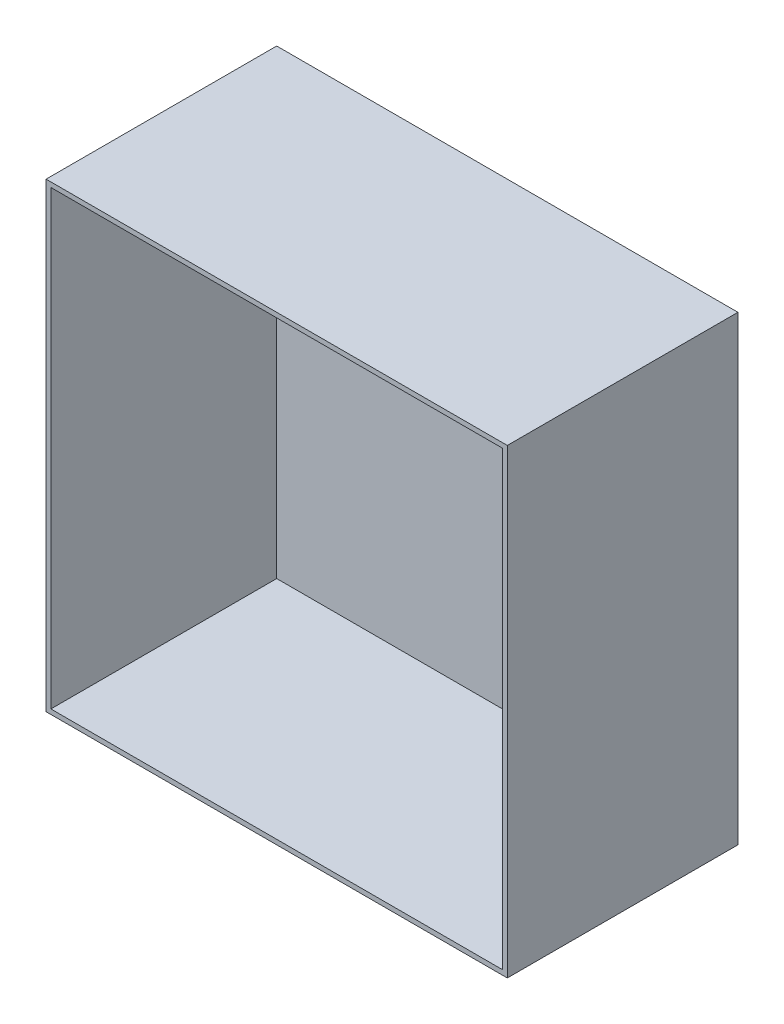
ISO-10303-21;
HEADER;
FILE_DESCRIPTION(('STEP AP214'),'2;1');
FILE_NAME('part.step','',(''),(''),'','','');
FILE_SCHEMA(('AUTOMOTIVE_DESIGN { 1 0 10303 214 1 1 1 1 }'));
ENDSEC;
DATA;
#1=APPLICATION_CONTEXT('core data for automotive mechanical design processes');
#2=APPLICATION_PROTOCOL_DEFINITION('international standard','automotive_design',2000,#1);
#3=PRODUCT_CONTEXT('',#1,'mechanical');
#4=PRODUCT('Part','Part','',(#3));
#5=PRODUCT_RELATED_PRODUCT_CATEGORY('part','',(#4));
#6=PRODUCT_DEFINITION_FORMATION('','',#4);
#7=PRODUCT_DEFINITION_CONTEXT('part definition',#1,'design');
#8=PRODUCT_DEFINITION('design','',#6,#7);
#9=PRODUCT_DEFINITION_SHAPE('','',#8);
#10=(LENGTH_UNIT() NAMED_UNIT(*) SI_UNIT(.MILLI.,.METRE.));
#11=(NAMED_UNIT(*) PLANE_ANGLE_UNIT() SI_UNIT($,.RADIAN.));
#12=(NAMED_UNIT(*) SI_UNIT($,.STERADIAN.) SOLID_ANGLE_UNIT());
#13=UNCERTAINTY_MEASURE_WITH_UNIT(LENGTH_MEASURE(1.E-05),#10,'distance_accuracy_value','');
#14=(GEOMETRIC_REPRESENTATION_CONTEXT(3) GLOBAL_UNCERTAINTY_ASSIGNED_CONTEXT((#13)) GLOBAL_UNIT_ASSIGNED_CONTEXT((#10,
#11,#12)) REPRESENTATION_CONTEXT('',''));
#15=CARTESIAN_POINT('',(0.,0.,0.));
#16=DIRECTION('',(0.,0.,1.));
#17=DIRECTION('',(1.,0.,0.));
#18=AXIS2_PLACEMENT_3D('',#15,#16,#17);
#19=CARTESIAN_POINT('',(0.,0.,76.2));
#20=DIRECTION('',(0.,0.,-1.));
#21=DIRECTION('',(-1.,0.,0.));
#22=AXIS2_PLACEMENT_3D('',#19,#20,#21);
#23=PLANE('',#22);
#24=DIRECTION('',(0.,-1.,0.));
#25=VECTOR('',#24,1.);
#26=CARTESIAN_POINT('',(0.,0.,76.2));
#27=LINE('',#26,#25);
#28=CARTESIAN_POINT('',(0.,152.4,76.2));
#29=VERTEX_POINT('',#28);
#30=CARTESIAN_POINT('',(0.,0.,76.2));
#31=VERTEX_POINT('',#30);
#32=EDGE_CURVE('E157',#29,#31,#27,.T.);
#33=ORIENTED_EDGE('',*,*,#32,.T.);
#34=DIRECTION('',(1.,0.,0.));
#35=VECTOR('',#34,1.);
#36=CARTESIAN_POINT('',(0.,0.,76.2));
#37=LINE('',#36,#35);
#38=CARTESIAN_POINT('',(152.4,0.,76.2));
#39=VERTEX_POINT('',#38);
#40=EDGE_CURVE('E92',#31,#39,#37,.T.);
#41=ORIENTED_EDGE('',*,*,#40,.T.);
#42=DIRECTION('',(0.,1.,0.));
#43=VECTOR('',#42,1.);
#44=CARTESIAN_POINT('',(152.4,0.,76.2));
#45=LINE('',#44,#43);
#46=CARTESIAN_POINT('',(152.4,152.4,76.2));
#47=VERTEX_POINT('',#46);
#48=EDGE_CURVE('E162',#39,#47,#45,.T.);
#49=ORIENTED_EDGE('',*,*,#48,.T.);
#50=DIRECTION('',(-1.,0.,0.));
#51=VECTOR('',#50,1.);
#52=CARTESIAN_POINT('',(0.,152.4,76.2));
#53=LINE('',#52,#51);
#54=EDGE_CURVE('E64',#47,#29,#53,.T.);
#55=ORIENTED_EDGE('',*,*,#54,.T.);
#56=EDGE_LOOP('',(#33,#41,#49,#55));
#57=FACE_BOUND('',#56,.T.);
#58=DIRECTION('',(0.,-1.,0.));
#59=VECTOR('',#58,1.);
#60=CARTESIAN_POINT('',(1.5875,0.,76.2));
#61=LINE('',#60,#59);
#62=CARTESIAN_POINT('',(1.5875,150.8125,76.2));
#63=VERTEX_POINT('',#62);
#64=CARTESIAN_POINT('',(1.5875,1.5875,76.2));
#65=VERTEX_POINT('',#64);
#66=EDGE_CURVE('E141',#63,#65,#61,.T.);
#67=ORIENTED_EDGE('',*,*,#66,.F.);
#68=DIRECTION('',(-1.,0.,0.));
#69=VECTOR('',#68,1.);
#70=CARTESIAN_POINT('',(0.,150.8125,76.2));
#71=LINE('',#70,#69);
#72=CARTESIAN_POINT('',(150.8125,150.8125,76.2));
#73=VERTEX_POINT('',#72);
#74=EDGE_CURVE('E154',#73,#63,#71,.T.);
#75=ORIENTED_EDGE('',*,*,#74,.F.);
#76=DIRECTION('',(0.,1.,0.));
#77=VECTOR('',#76,1.);
#78=CARTESIAN_POINT('',(150.8125,0.,76.2));
#79=LINE('',#78,#77);
#80=CARTESIAN_POINT('',(150.8125,1.5875,76.2));
#81=VERTEX_POINT('',#80);
#82=EDGE_CURVE('E151',#81,#73,#79,.T.);
#83=ORIENTED_EDGE('',*,*,#82,.F.);
#84=DIRECTION('',(1.,0.,0.));
#85=VECTOR('',#84,1.);
#86=CARTESIAN_POINT('',(0.,1.5875,76.2));
#87=LINE('',#86,#85);
#88=EDGE_CURVE('E130',#65,#81,#87,.T.);
#89=ORIENTED_EDGE('',*,*,#88,.F.);
#90=EDGE_LOOP('',(#67,#75,#83,#89));
#91=FACE_BOUND('',#90,.T.);
#92=ADVANCED_FACE('F39',(#57,#91),#23,.F.);
#93=CARTESIAN_POINT('',(0.,0.,76.2));
#94=DIRECTION('',(1.,0.,0.));
#95=DIRECTION('',(0.,0.,-1.));
#96=AXIS2_PLACEMENT_3D('',#93,#94,#95);
#97=PLANE('',#96);
#98=DIRECTION('',(0.,-1.,0.));
#99=VECTOR('',#98,1.);
#100=CARTESIAN_POINT('',(0.,0.,0.));
#101=LINE('',#100,#99);
#102=CARTESIAN_POINT('',(0.,152.4,0.));
#103=VERTEX_POINT('',#102);
#104=CARTESIAN_POINT('',(0.,0.,0.));
#105=VERTEX_POINT('',#104);
#106=EDGE_CURVE('E168',#103,#105,#101,.T.);
#107=ORIENTED_EDGE('',*,*,#106,.T.);
#108=DIRECTION('',(0.,0.,-1.));
#109=VECTOR('',#108,1.);
#110=CARTESIAN_POINT('',(0.,0.,76.2));
#111=LINE('',#110,#109);
#112=EDGE_CURVE('E11',#31,#105,#111,.T.);
#113=ORIENTED_EDGE('',*,*,#112,.F.);
#114=ORIENTED_EDGE('',*,*,#32,.F.);
#115=DIRECTION('',(0.,0.,-1.));
#116=VECTOR('',#115,1.);
#117=CARTESIAN_POINT('',(0.,152.4,76.2));
#118=LINE('',#117,#116);
#119=EDGE_CURVE('E167',#29,#103,#118,.T.);
#120=ORIENTED_EDGE('',*,*,#119,.T.);
#121=EDGE_LOOP('',(#107,#113,#114,#120));
#122=FACE_BOUND('',#121,.T.);
#123=ADVANCED_FACE('F41',(#122),#97,.F.);
#124=CARTESIAN_POINT('',(0.,0.,76.2));
#125=DIRECTION('',(0.,1.,0.));
#126=DIRECTION('',(0.,0.,1.));
#127=AXIS2_PLACEMENT_3D('',#124,#125,#126);
#128=PLANE('',#127);
#129=DIRECTION('',(1.,0.,0.));
#130=VECTOR('',#129,1.);
#131=CARTESIAN_POINT('',(0.,0.,0.));
#132=LINE('',#131,#130);
#133=CARTESIAN_POINT('',(152.4,0.,0.));
#134=VERTEX_POINT('',#133);
#135=EDGE_CURVE('E172',#105,#134,#132,.T.);
#136=ORIENTED_EDGE('',*,*,#135,.T.);
#137=DIRECTION('',(0.,0.,-1.));
#138=VECTOR('',#137,1.);
#139=CARTESIAN_POINT('',(152.4,0.,76.2));
#140=LINE('',#139,#138);
#141=EDGE_CURVE('E48',#39,#134,#140,.T.);
#142=ORIENTED_EDGE('',*,*,#141,.F.);
#143=ORIENTED_EDGE('',*,*,#40,.F.);
#144=ORIENTED_EDGE('',*,*,#112,.T.);
#145=EDGE_LOOP('',(#136,#142,#143,#144));
#146=FACE_BOUND('',#145,.T.);
#147=ADVANCED_FACE('F206',(#146),#128,.F.);
#148=CARTESIAN_POINT('',(152.4,0.,76.2));
#149=DIRECTION('',(-1.,0.,0.));
#150=DIRECTION('',(0.,0.,1.));
#151=AXIS2_PLACEMENT_3D('',#148,#149,#150);
#152=PLANE('',#151);
#153=DIRECTION('',(0.,1.,0.));
#154=VECTOR('',#153,1.);
#155=CARTESIAN_POINT('',(152.4,0.,0.));
#156=LINE('',#155,#154);
#157=CARTESIAN_POINT('',(152.4,152.4,0.));
#158=VERTEX_POINT('',#157);
#159=EDGE_CURVE('E175',#134,#158,#156,.T.);
#160=ORIENTED_EDGE('',*,*,#159,.T.);
#161=DIRECTION('',(0.,0.,-1.));
#162=VECTOR('',#161,1.);
#163=CARTESIAN_POINT('',(152.4,152.4,76.2));
#164=LINE('',#163,#162);
#165=EDGE_CURVE('E182',#47,#158,#164,.T.);
#166=ORIENTED_EDGE('',*,*,#165,.F.);
#167=ORIENTED_EDGE('',*,*,#48,.F.);
#168=ORIENTED_EDGE('',*,*,#141,.T.);
#169=EDGE_LOOP('',(#160,#166,#167,#168));
#170=FACE_BOUND('',#169,.T.);
#171=ADVANCED_FACE('F189',(#170),#152,.F.);
#172=CARTESIAN_POINT('',(0.,152.4,76.2));
#173=DIRECTION('',(0.,-1.,0.));
#174=DIRECTION('',(0.,0.,-1.));
#175=AXIS2_PLACEMENT_3D('',#172,#173,#174);
#176=PLANE('',#175);
#177=DIRECTION('',(-1.,0.,0.));
#178=VECTOR('',#177,1.);
#179=CARTESIAN_POINT('',(0.,152.4,0.));
#180=LINE('',#179,#178);
#181=EDGE_CURVE('E85',#158,#103,#180,.T.);
#182=ORIENTED_EDGE('',*,*,#181,.T.);
#183=ORIENTED_EDGE('',*,*,#119,.F.);
#184=ORIENTED_EDGE('',*,*,#54,.F.);
#185=ORIENTED_EDGE('',*,*,#165,.T.);
#186=EDGE_LOOP('',(#182,#183,#184,#185));
#187=FACE_BOUND('',#186,.T.);
#188=ADVANCED_FACE('F197',(#187),#176,.F.);
#189=CARTESIAN_POINT('',(0.,0.,0.));
#190=DIRECTION('',(0.,0.,-1.));
#191=DIRECTION('',(-1.,0.,0.));
#192=AXIS2_PLACEMENT_3D('',#189,#190,#191);
#193=PLANE('',#192);
#194=ORIENTED_EDGE('',*,*,#106,.F.);
#195=ORIENTED_EDGE('',*,*,#181,.F.);
#196=ORIENTED_EDGE('',*,*,#159,.F.);
#197=ORIENTED_EDGE('',*,*,#135,.F.);
#198=EDGE_LOOP('',(#194,#195,#196,#197));
#199=FACE_BOUND('',#198,.T.);
#200=ADVANCED_FACE('F193',(#199),#193,.T.);
#201=CARTESIAN_POINT('',(1.5875,0.,76.2));
#202=DIRECTION('',(1.,0.,0.));
#203=DIRECTION('',(0.,0.,-1.));
#204=AXIS2_PLACEMENT_3D('',#201,#202,#203);
#205=PLANE('',#204);
#206=DIRECTION('',(0.,-1.,0.));
#207=VECTOR('',#206,1.);
#208=CARTESIAN_POINT('',(1.5875,0.,1.5875));
#209=LINE('',#208,#207);
#210=CARTESIAN_POINT('',(1.5875,150.8125,1.5875));
#211=VERTEX_POINT('',#210);
#212=CARTESIAN_POINT('',(1.5875,1.5875,1.5875));
#213=VERTEX_POINT('',#212);
#214=EDGE_CURVE('E120',#211,#213,#209,.T.);
#215=ORIENTED_EDGE('',*,*,#214,.F.);
#216=DIRECTION('',(0.,0.,-1.));
#217=VECTOR('',#216,1.);
#218=CARTESIAN_POINT('',(1.5875,150.8125,76.2));
#219=LINE('',#218,#217);
#220=EDGE_CURVE('E145',#63,#211,#219,.T.);
#221=ORIENTED_EDGE('',*,*,#220,.F.);
#222=ORIENTED_EDGE('',*,*,#66,.T.);
#223=DIRECTION('',(0.,0.,-1.));
#224=VECTOR('',#223,1.);
#225=CARTESIAN_POINT('',(1.5875,1.5875,76.2));
#226=LINE('',#225,#224);
#227=EDGE_CURVE('E134',#65,#213,#226,.T.);
#228=ORIENTED_EDGE('',*,*,#227,.T.);
#229=EDGE_LOOP('',(#215,#221,#222,#228));
#230=FACE_BOUND('',#229,.T.);
#231=ADVANCED_FACE('F204',(#230),#205,.T.);
#232=CARTESIAN_POINT('',(0.,1.5875,76.2));
#233=DIRECTION('',(0.,1.,0.));
#234=DIRECTION('',(0.,0.,1.));
#235=AXIS2_PLACEMENT_3D('',#232,#233,#234);
#236=PLANE('',#235);
#237=DIRECTION('',(1.,0.,0.));
#238=VECTOR('',#237,1.);
#239=CARTESIAN_POINT('',(0.,1.5875,1.5875));
#240=LINE('',#239,#238);
#241=CARTESIAN_POINT('',(150.8125,1.5875,1.5875));
#242=VERTEX_POINT('',#241);
#243=EDGE_CURVE('E114',#213,#242,#240,.T.);
#244=ORIENTED_EDGE('',*,*,#243,.F.);
#245=ORIENTED_EDGE('',*,*,#227,.F.);
#246=ORIENTED_EDGE('',*,*,#88,.T.);
#247=DIRECTION('',(0.,0.,-1.));
#248=VECTOR('',#247,1.);
#249=CARTESIAN_POINT('',(150.8125,1.5875,76.2));
#250=LINE('',#249,#248);
#251=EDGE_CURVE('E127',#81,#242,#250,.T.);
#252=ORIENTED_EDGE('',*,*,#251,.T.);
#253=EDGE_LOOP('',(#244,#245,#246,#252));
#254=FACE_BOUND('',#253,.T.);
#255=ADVANCED_FACE('F128',(#254),#236,.T.);
#256=CARTESIAN_POINT('',(150.8125,0.,76.2));
#257=DIRECTION('',(-1.,0.,0.));
#258=DIRECTION('',(0.,0.,1.));
#259=AXIS2_PLACEMENT_3D('',#256,#257,#258);
#260=PLANE('',#259);
#261=DIRECTION('',(0.,1.,0.));
#262=VECTOR('',#261,1.);
#263=CARTESIAN_POINT('',(150.8125,0.,1.5875));
#264=LINE('',#263,#262);
#265=CARTESIAN_POINT('',(150.8125,150.8125,1.5875));
#266=VERTEX_POINT('',#265);
#267=EDGE_CURVE('E118',#242,#266,#264,.T.);
#268=ORIENTED_EDGE('',*,*,#267,.F.);
#269=ORIENTED_EDGE('',*,*,#251,.F.);
#270=ORIENTED_EDGE('',*,*,#82,.T.);
#271=DIRECTION('',(0.,0.,-1.));
#272=VECTOR('',#271,1.);
#273=CARTESIAN_POINT('',(150.8125,150.8125,76.2));
#274=LINE('',#273,#272);
#275=EDGE_CURVE('E55',#73,#266,#274,.T.);
#276=ORIENTED_EDGE('',*,*,#275,.T.);
#277=EDGE_LOOP('',(#268,#269,#270,#276));
#278=FACE_BOUND('',#277,.T.);
#279=ADVANCED_FACE('F136',(#278),#260,.T.);
#280=CARTESIAN_POINT('',(0.,150.8125,76.2));
#281=DIRECTION('',(0.,-1.,0.));
#282=DIRECTION('',(0.,0.,-1.));
#283=AXIS2_PLACEMENT_3D('',#280,#281,#282);
#284=PLANE('',#283);
#285=DIRECTION('',(-1.,0.,0.));
#286=VECTOR('',#285,1.);
#287=CARTESIAN_POINT('',(0.,150.8125,1.5875));
#288=LINE('',#287,#286);
#289=EDGE_CURVE('E138',#266,#211,#288,.T.);
#290=ORIENTED_EDGE('',*,*,#289,.F.);
#291=ORIENTED_EDGE('',*,*,#275,.F.);
#292=ORIENTED_EDGE('',*,*,#74,.T.);
#293=ORIENTED_EDGE('',*,*,#220,.T.);
#294=EDGE_LOOP('',(#290,#291,#292,#293));
#295=FACE_BOUND('',#294,.T.);
#296=ADVANCED_FACE('F217',(#295),#284,.T.);
#297=CARTESIAN_POINT('',(0.,0.,1.5875));
#298=DIRECTION('',(0.,0.,-1.));
#299=DIRECTION('',(-1.,0.,0.));
#300=AXIS2_PLACEMENT_3D('',#297,#298,#299);
#301=PLANE('',#300);
#302=ORIENTED_EDGE('',*,*,#214,.T.);
#303=ORIENTED_EDGE('',*,*,#243,.T.);
#304=ORIENTED_EDGE('',*,*,#267,.T.);
#305=ORIENTED_EDGE('',*,*,#289,.T.);
#306=EDGE_LOOP('',(#302,#303,#304,#305));
#307=FACE_BOUND('',#306,.T.);
#308=ADVANCED_FACE('F116',(#307),#301,.F.);
#309=CLOSED_SHELL('',(#92,#123,#147,#171,#188,#200,#231,#255,#279,#296,#308));
#310=MANIFOLD_SOLID_BREP('B2',#309);
#311=ADVANCED_BREP_SHAPE_REPRESENTATION('',(#18,#310),#14);
#312=SHAPE_DEFINITION_REPRESENTATION(#9,#311);
ENDSEC;
END-ISO-10303-21;
